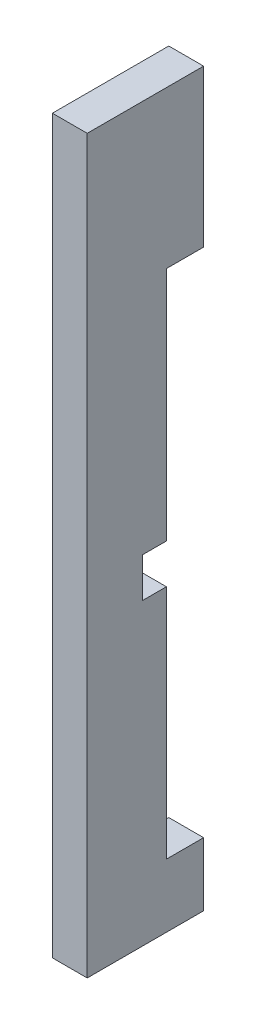
ISO-10303-21;
HEADER;
FILE_DESCRIPTION(('STEP AP214'),'2;1');
FILE_NAME('part.step','',(''),(''),'','','');
FILE_SCHEMA(('AUTOMOTIVE_DESIGN { 1 0 10303 214 1 1 1 1 }'));
ENDSEC;
DATA;
#1=APPLICATION_CONTEXT('core data for automotive mechanical design processes');
#2=APPLICATION_PROTOCOL_DEFINITION('international standard','automotive_design',2000,#1);
#3=PRODUCT_CONTEXT('',#1,'mechanical');
#4=PRODUCT('Part','Part','',(#3));
#5=PRODUCT_RELATED_PRODUCT_CATEGORY('part','',(#4));
#6=PRODUCT_DEFINITION_FORMATION('','',#4);
#7=PRODUCT_DEFINITION_CONTEXT('part definition',#1,'design');
#8=PRODUCT_DEFINITION('design','',#6,#7);
#9=PRODUCT_DEFINITION_SHAPE('','',#8);
#10=(LENGTH_UNIT() NAMED_UNIT(*) SI_UNIT(.MILLI.,.METRE.));
#11=(NAMED_UNIT(*) PLANE_ANGLE_UNIT() SI_UNIT($,.RADIAN.));
#12=(NAMED_UNIT(*) SI_UNIT($,.STERADIAN.) SOLID_ANGLE_UNIT());
#13=UNCERTAINTY_MEASURE_WITH_UNIT(LENGTH_MEASURE(1.E-05),#10,'distance_accuracy_value','');
#14=(GEOMETRIC_REPRESENTATION_CONTEXT(3) GLOBAL_UNCERTAINTY_ASSIGNED_CONTEXT((#13)) GLOBAL_UNIT_ASSIGNED_CONTEXT((#10,
#11,#12)) REPRESENTATION_CONTEXT('',''));
#15=CARTESIAN_POINT('',(0.,0.,0.));
#16=DIRECTION('',(0.,0.,1.));
#17=DIRECTION('',(1.,0.,0.));
#18=AXIS2_PLACEMENT_3D('',#15,#16,#17);
#19=CARTESIAN_POINT('',(0.,0.,0.));
#20=DIRECTION('',(0.,0.,-1.));
#21=DIRECTION('',(-1.,0.,0.));
#22=AXIS2_PLACEMENT_3D('',#19,#20,#21);
#23=PLANE('',#22);
#24=DIRECTION('',(1.,0.,0.));
#25=VECTOR('',#24,1.);
#26=CARTESIAN_POINT('',(105.,162.,9.33281230075522E-13));
#27=LINE('',#26,#25);
#28=CARTESIAN_POINT('',(118.,162.,9.33281230075522E-13));
#29=VERTEX_POINT('',#28);
#30=CARTESIAN_POINT('',(140.,162.,9.33281230075522E-13));
#31=VERTEX_POINT('',#30);
#32=EDGE_CURVE('E127',#29,#31,#27,.T.);
#33=ORIENTED_EDGE('',*,*,#32,.F.);
#34=DIRECTION('',(0.,-1.,0.));
#35=VECTOR('',#34,1.);
#36=CARTESIAN_POINT('',(118.,261.,0.));
#37=LINE('',#36,#35);
#38=CARTESIAN_POINT('',(118.,261.,0.));
#39=VERTEX_POINT('',#38);
#40=EDGE_CURVE('E161',#39,#29,#37,.T.);
#41=ORIENTED_EDGE('',*,*,#40,.F.);
#42=DIRECTION('',(-1.,0.,0.));
#43=VECTOR('',#42,1.);
#44=CARTESIAN_POINT('',(140.,261.,0.));
#45=LINE('',#44,#43);
#46=CARTESIAN_POINT('',(140.,261.,0.));
#47=VERTEX_POINT('',#46);
#48=EDGE_CURVE('E147',#47,#39,#45,.T.);
#49=ORIENTED_EDGE('',*,*,#48,.F.);
#50=DIRECTION('',(0.,1.,0.));
#51=VECTOR('',#50,1.);
#52=CARTESIAN_POINT('',(140.,261.,0.));
#53=LINE('',#52,#51);
#54=EDGE_CURVE('E142',#31,#47,#53,.T.);
#55=ORIENTED_EDGE('',*,*,#54,.F.);
#56=EDGE_LOOP('',(#33,#41,#49,#55));
#57=FACE_BOUND('',#56,.T.);
#58=ADVANCED_FACE('F37',(#57),#23,.T.);
#59=CARTESIAN_POINT('',(140.,261.,73.5));
#60=DIRECTION('',(-1.,0.,0.));
#61=DIRECTION('',(0.,-1.,0.));
#62=AXIS2_PLACEMENT_3D('',#59,#60,#61);
#63=PLANE('',#62);
#64=CARTESIAN_POINT('',(140.,-201.,0.));
#65=VERTEX_POINT('',#64);
#66=CARTESIAN_POINT('',(140.,-161.,4.02455846426619E-13));
#67=VERTEX_POINT('',#66);
#68=EDGE_CURVE('E149',#65,#67,#53,.T.);
#69=ORIENTED_EDGE('',*,*,#68,.T.);
#70=DIRECTION('',(0.,0.,-1.));
#71=VECTOR('',#70,1.);
#72=CARTESIAN_POINT('',(140.,-161.,4.02455846426619E-13));
#73=LINE('',#72,#71);
#74=CARTESIAN_POINT('',(140.,-161.,23.5));
#75=VERTEX_POINT('',#74);
#76=EDGE_CURVE('E137',#75,#67,#73,.T.);
#77=ORIENTED_EDGE('',*,*,#76,.F.);
#78=DIRECTION('',(0.,-1.,0.));
#79=VECTOR('',#78,1.);
#80=CARTESIAN_POINT('',(140.,162.,23.5));
#81=LINE('',#80,#79);
#82=CARTESIAN_POINT('',(140.,-11.9999999999998,23.5));
#83=VERTEX_POINT('',#82);
#84=EDGE_CURVE('E145',#83,#75,#81,.T.);
#85=ORIENTED_EDGE('',*,*,#84,.F.);
#86=DIRECTION('',(0.,0.,1.));
#87=VECTOR('',#86,1.);
#88=CARTESIAN_POINT('',(140.,-11.9999999999998,73.5));
#89=LINE('',#88,#87);
#90=CARTESIAN_POINT('',(140.,-11.9999999999998,38.5));
#91=VERTEX_POINT('',#90);
#92=EDGE_CURVE('E183',#83,#91,#89,.T.);
#93=ORIENTED_EDGE('',*,*,#92,.T.);
#94=DIRECTION('',(0.,1.,0.));
#95=VECTOR('',#94,1.);
#96=CARTESIAN_POINT('',(140.,261.,38.4999999999994));
#97=LINE('',#96,#95);
#98=CARTESIAN_POINT('',(140.,13.0000000000002,38.5));
#99=VERTEX_POINT('',#98);
#100=EDGE_CURVE('E150',#91,#99,#97,.T.);
#101=ORIENTED_EDGE('',*,*,#100,.T.);
#102=DIRECTION('',(0.,0.,-1.));
#103=VECTOR('',#102,1.);
#104=CARTESIAN_POINT('',(140.,13.0000000000002,73.5));
#105=LINE('',#104,#103);
#106=CARTESIAN_POINT('',(140.,13.0000000000002,23.5));
#107=VERTEX_POINT('',#106);
#108=EDGE_CURVE('E153',#99,#107,#105,.T.);
#109=ORIENTED_EDGE('',*,*,#108,.T.);
#110=CARTESIAN_POINT('',(140.,162.,23.5));
#111=VERTEX_POINT('',#110);
#112=EDGE_CURVE('E52',#111,#107,#81,.T.);
#113=ORIENTED_EDGE('',*,*,#112,.F.);
#114=DIRECTION('',(0.,0.,1.));
#115=VECTOR('',#114,1.);
#116=CARTESIAN_POINT('',(140.,162.,9.33281230075522E-13));
#117=LINE('',#116,#115);
#118=EDGE_CURVE('E131',#31,#111,#117,.T.);
#119=ORIENTED_EDGE('',*,*,#118,.F.);
#120=ORIENTED_EDGE('',*,*,#54,.T.);
#121=DIRECTION('',(0.,0.,-1.));
#122=VECTOR('',#121,1.);
#123=CARTESIAN_POINT('',(140.,261.,73.5));
#124=LINE('',#123,#122);
#125=CARTESIAN_POINT('',(140.,261.,73.5));
#126=VERTEX_POINT('',#125);
#127=EDGE_CURVE('E175',#126,#47,#124,.T.);
#128=ORIENTED_EDGE('',*,*,#127,.F.);
#129=DIRECTION('',(0.,1.,0.));
#130=VECTOR('',#129,1.);
#131=CARTESIAN_POINT('',(140.,261.,73.5));
#132=LINE('',#131,#130);
#133=CARTESIAN_POINT('',(140.,-201.,73.5));
#134=VERTEX_POINT('',#133);
#135=EDGE_CURVE('E165',#134,#126,#132,.T.);
#136=ORIENTED_EDGE('',*,*,#135,.F.);
#137=DIRECTION('',(0.,0.,-1.));
#138=VECTOR('',#137,1.);
#139=CARTESIAN_POINT('',(140.,-201.,73.5));
#140=LINE('',#139,#138);
#141=EDGE_CURVE('E166',#134,#65,#140,.T.);
#142=ORIENTED_EDGE('',*,*,#141,.T.);
#143=EDGE_LOOP('',(#69,#77,#85,#93,#101,#109,#113,#119,#120,#128,#136,#142));
#144=FACE_BOUND('',#143,.T.);
#145=ADVANCED_FACE('F39',(#144),#63,.F.);
#146=CARTESIAN_POINT('',(140.,261.,73.5));
#147=DIRECTION('',(0.,-1.,0.));
#148=DIRECTION('',(0.,0.,-1.));
#149=AXIS2_PLACEMENT_3D('',#146,#147,#148);
#150=PLANE('',#149);
#151=ORIENTED_EDGE('',*,*,#48,.T.);
#152=DIRECTION('',(0.,0.,-1.));
#153=VECTOR('',#152,1.);
#154=CARTESIAN_POINT('',(118.,261.,73.5));
#155=LINE('',#154,#153);
#156=CARTESIAN_POINT('',(118.,261.,73.5));
#157=VERTEX_POINT('',#156);
#158=EDGE_CURVE('E172',#157,#39,#155,.T.);
#159=ORIENTED_EDGE('',*,*,#158,.F.);
#160=DIRECTION('',(-1.,0.,0.));
#161=VECTOR('',#160,1.);
#162=CARTESIAN_POINT('',(140.,261.,73.5));
#163=LINE('',#162,#161);
#164=EDGE_CURVE('E211',#126,#157,#163,.T.);
#165=ORIENTED_EDGE('',*,*,#164,.F.);
#166=ORIENTED_EDGE('',*,*,#127,.T.);
#167=EDGE_LOOP('',(#151,#159,#165,#166));
#168=FACE_BOUND('',#167,.T.);
#169=ADVANCED_FACE('F225',(#168),#150,.F.);
#170=CARTESIAN_POINT('',(118.,261.,73.5));
#171=DIRECTION('',(1.,0.,0.));
#172=DIRECTION('',(0.,1.,0.));
#173=AXIS2_PLACEMENT_3D('',#170,#171,#172);
#174=PLANE('',#173);
#175=DIRECTION('',(0.,-1.,0.));
#176=VECTOR('',#175,1.);
#177=CARTESIAN_POINT('',(118.,261.,23.5));
#178=LINE('',#177,#176);
#179=CARTESIAN_POINT('',(118.,-11.9999999999998,23.5));
#180=VERTEX_POINT('',#179);
#181=CARTESIAN_POINT('',(118.,-161.,23.5));
#182=VERTEX_POINT('',#181);
#183=EDGE_CURVE('E60',#180,#182,#178,.T.);
#184=ORIENTED_EDGE('',*,*,#183,.T.);
#185=DIRECTION('',(0.,0.,-1.));
#186=VECTOR('',#185,1.);
#187=CARTESIAN_POINT('',(118.,-161.,73.5));
#188=LINE('',#187,#186);
#189=CARTESIAN_POINT('',(118.,-161.,4.02455846426619E-13));
#190=VERTEX_POINT('',#189);
#191=EDGE_CURVE('E193',#182,#190,#188,.T.);
#192=ORIENTED_EDGE('',*,*,#191,.T.);
#193=CARTESIAN_POINT('',(118.,-201.,0.));
#194=VERTEX_POINT('',#193);
#195=EDGE_CURVE('E160',#190,#194,#37,.T.);
#196=ORIENTED_EDGE('',*,*,#195,.T.);
#197=DIRECTION('',(0.,0.,-1.));
#198=VECTOR('',#197,1.);
#199=CARTESIAN_POINT('',(118.,-201.,73.5));
#200=LINE('',#199,#198);
#201=CARTESIAN_POINT('',(118.,-201.,73.5));
#202=VERTEX_POINT('',#201);
#203=EDGE_CURVE('E169',#202,#194,#200,.T.);
#204=ORIENTED_EDGE('',*,*,#203,.F.);
#205=DIRECTION('',(0.,-1.,0.));
#206=VECTOR('',#205,1.);
#207=CARTESIAN_POINT('',(118.,261.,73.5));
#208=LINE('',#207,#206);
#209=EDGE_CURVE('E212',#157,#202,#208,.T.);
#210=ORIENTED_EDGE('',*,*,#209,.F.);
#211=ORIENTED_EDGE('',*,*,#158,.T.);
#212=ORIENTED_EDGE('',*,*,#40,.T.);
#213=DIRECTION('',(0.,0.,1.));
#214=VECTOR('',#213,1.);
#215=CARTESIAN_POINT('',(118.,162.,73.5));
#216=LINE('',#215,#214);
#217=CARTESIAN_POINT('',(118.,162.,23.5));
#218=VERTEX_POINT('',#217);
#219=EDGE_CURVE('E11',#29,#218,#216,.T.);
#220=ORIENTED_EDGE('',*,*,#219,.T.);
#221=CARTESIAN_POINT('',(118.,13.0000000000002,23.5));
#222=VERTEX_POINT('',#221);
#223=EDGE_CURVE('E197',#218,#222,#178,.T.);
#224=ORIENTED_EDGE('',*,*,#223,.T.);
#225=DIRECTION('',(0.,0.,-1.));
#226=VECTOR('',#225,1.);
#227=CARTESIAN_POINT('',(118.,13.0000000000002,0.));
#228=LINE('',#227,#226);
#229=CARTESIAN_POINT('',(118.,13.0000000000002,38.5));
#230=VERTEX_POINT('',#229);
#231=EDGE_CURVE('E195',#230,#222,#228,.T.);
#232=ORIENTED_EDGE('',*,*,#231,.F.);
#233=DIRECTION('',(0.,1.,0.));
#234=VECTOR('',#233,1.);
#235=CARTESIAN_POINT('',(118.,13.0000000000002,38.5));
#236=LINE('',#235,#234);
#237=CARTESIAN_POINT('',(118.,-11.9999999999998,38.5));
#238=VERTEX_POINT('',#237);
#239=EDGE_CURVE('E192',#238,#230,#236,.T.);
#240=ORIENTED_EDGE('',*,*,#239,.F.);
#241=DIRECTION('',(0.,0.,1.));
#242=VECTOR('',#241,1.);
#243=CARTESIAN_POINT('',(118.,-11.9999999999998,38.5));
#244=LINE('',#243,#242);
#245=EDGE_CURVE('E181',#180,#238,#244,.T.);
#246=ORIENTED_EDGE('',*,*,#245,.F.);
#247=EDGE_LOOP('',(#184,#192,#196,#204,#210,#211,#212,#220,#224,#232,#240,#246));
#248=FACE_BOUND('',#247,.T.);
#249=ADVANCED_FACE('F188',(#248),#174,.F.);
#250=CARTESIAN_POINT('',(140.,-201.,73.5));
#251=DIRECTION('',(0.,1.,0.));
#252=DIRECTION('',(0.,0.,1.));
#253=AXIS2_PLACEMENT_3D('',#250,#251,#252);
#254=PLANE('',#253);
#255=DIRECTION('',(1.,0.,0.));
#256=VECTOR('',#255,1.);
#257=CARTESIAN_POINT('',(140.,-201.,0.));
#258=LINE('',#257,#256);
#259=EDGE_CURVE('E163',#194,#65,#258,.T.);
#260=ORIENTED_EDGE('',*,*,#259,.T.);
#261=ORIENTED_EDGE('',*,*,#141,.F.);
#262=DIRECTION('',(1.,0.,0.));
#263=VECTOR('',#262,1.);
#264=CARTESIAN_POINT('',(140.,-201.,73.5));
#265=LINE('',#264,#263);
#266=EDGE_CURVE('E157',#202,#134,#265,.T.);
#267=ORIENTED_EDGE('',*,*,#266,.F.);
#268=ORIENTED_EDGE('',*,*,#203,.T.);
#269=EDGE_LOOP('',(#260,#261,#267,#268));
#270=FACE_BOUND('',#269,.T.);
#271=ADVANCED_FACE('F221',(#270),#254,.F.);
#272=CARTESIAN_POINT('',(0.,0.,73.5));
#273=DIRECTION('',(0.,0.,-1.));
#274=DIRECTION('',(-1.,0.,0.));
#275=AXIS2_PLACEMENT_3D('',#272,#273,#274);
#276=PLANE('',#275);
#277=ORIENTED_EDGE('',*,*,#135,.T.);
#278=ORIENTED_EDGE('',*,*,#164,.T.);
#279=ORIENTED_EDGE('',*,*,#209,.T.);
#280=ORIENTED_EDGE('',*,*,#266,.T.);
#281=EDGE_LOOP('',(#277,#278,#279,#280));
#282=FACE_BOUND('',#281,.T.);
#283=ADVANCED_FACE('F218',(#282),#276,.F.);
#284=DIRECTION('',(1.,0.,0.));
#285=VECTOR('',#284,1.);
#286=CARTESIAN_POINT('',(105.,-161.,4.02455846426619E-13));
#287=LINE('',#286,#285);
#288=EDGE_CURVE('E231',#190,#67,#287,.T.);
#289=ORIENTED_EDGE('',*,*,#288,.T.);
#290=ORIENTED_EDGE('',*,*,#68,.F.);
#291=ORIENTED_EDGE('',*,*,#259,.F.);
#292=ORIENTED_EDGE('',*,*,#195,.F.);
#293=EDGE_LOOP('',(#289,#290,#291,#292));
#294=FACE_BOUND('',#293,.T.);
#295=ADVANCED_FACE('F230',(#294),#23,.T.);
#296=CARTESIAN_POINT('',(153.,13.0000000000002,38.5));
#297=DIRECTION('',(0.,0.,1.));
#298=DIRECTION('',(0.,-1.,0.));
#299=AXIS2_PLACEMENT_3D('',#296,#297,#298);
#300=PLANE('',#299);
#301=DIRECTION('',(-1.,0.,0.));
#302=VECTOR('',#301,1.);
#303=CARTESIAN_POINT('',(153.,-11.9999999999998,38.5));
#304=LINE('',#303,#302);
#305=EDGE_CURVE('E203',#91,#238,#304,.T.);
#306=ORIENTED_EDGE('',*,*,#305,.T.);
#307=ORIENTED_EDGE('',*,*,#239,.T.);
#308=DIRECTION('',(-1.,0.,0.));
#309=VECTOR('',#308,1.);
#310=CARTESIAN_POINT('',(153.,13.0000000000002,38.5));
#311=LINE('',#310,#309);
#312=EDGE_CURVE('E204',#99,#230,#311,.T.);
#313=ORIENTED_EDGE('',*,*,#312,.F.);
#314=ORIENTED_EDGE('',*,*,#100,.F.);
#315=EDGE_LOOP('',(#306,#307,#313,#314));
#316=FACE_BOUND('',#315,.T.);
#317=ADVANCED_FACE('F248',(#316),#300,.F.);
#318=CARTESIAN_POINT('',(153.,13.0000000000002,0.));
#319=DIRECTION('',(0.,1.,0.));
#320=DIRECTION('',(-1.,0.,0.));
#321=AXIS2_PLACEMENT_3D('',#318,#319,#320);
#322=PLANE('',#321);
#323=ORIENTED_EDGE('',*,*,#231,.T.);
#324=DIRECTION('',(1.,0.,0.));
#325=VECTOR('',#324,1.);
#326=CARTESIAN_POINT('',(153.,13.0000000000002,23.5));
#327=LINE('',#326,#325);
#328=EDGE_CURVE('E241',#222,#107,#327,.T.);
#329=ORIENTED_EDGE('',*,*,#328,.T.);
#330=ORIENTED_EDGE('',*,*,#108,.F.);
#331=ORIENTED_EDGE('',*,*,#312,.T.);
#332=EDGE_LOOP('',(#323,#329,#330,#331));
#333=FACE_BOUND('',#332,.T.);
#334=ADVANCED_FACE('F244',(#333),#322,.F.);
#335=CARTESIAN_POINT('',(153.,-11.9999999999998,38.5));
#336=DIRECTION('',(0.,-1.,0.));
#337=DIRECTION('',(1.,0.,0.));
#338=AXIS2_PLACEMENT_3D('',#335,#336,#337);
#339=PLANE('',#338);
#340=ORIENTED_EDGE('',*,*,#92,.F.);
#341=DIRECTION('',(-1.,0.,0.));
#342=VECTOR('',#341,1.);
#343=CARTESIAN_POINT('',(153.,-11.9999999999998,23.5));
#344=LINE('',#343,#342);
#345=EDGE_CURVE('E45',#83,#180,#344,.T.);
#346=ORIENTED_EDGE('',*,*,#345,.T.);
#347=ORIENTED_EDGE('',*,*,#245,.T.);
#348=ORIENTED_EDGE('',*,*,#305,.F.);
#349=EDGE_LOOP('',(#340,#346,#347,#348));
#350=FACE_BOUND('',#349,.T.);
#351=ADVANCED_FACE('F179',(#350),#339,.F.);
#352=CARTESIAN_POINT('',(105.,162.,23.5));
#353=DIRECTION('',(0.,0.,1.));
#354=DIRECTION('',(0.,-1.,0.));
#355=AXIS2_PLACEMENT_3D('',#352,#353,#354);
#356=PLANE('',#355);
#357=ORIENTED_EDGE('',*,*,#345,.F.);
#358=ORIENTED_EDGE('',*,*,#84,.T.);
#359=DIRECTION('',(1.,0.,0.));
#360=VECTOR('',#359,1.);
#361=CARTESIAN_POINT('',(105.,-161.,23.5));
#362=LINE('',#361,#360);
#363=EDGE_CURVE('E238',#182,#75,#362,.T.);
#364=ORIENTED_EDGE('',*,*,#363,.F.);
#365=ORIENTED_EDGE('',*,*,#183,.F.);
#366=EDGE_LOOP('',(#357,#358,#364,#365));
#367=FACE_BOUND('',#366,.T.);
#368=ADVANCED_FACE('F306',(#367),#356,.F.);
#369=CARTESIAN_POINT('',(105.,-161.,4.02455846426619E-13));
#370=DIRECTION('',(0.,-1.,0.));
#371=DIRECTION('',(1.,0.,0.));
#372=AXIS2_PLACEMENT_3D('',#369,#370,#371);
#373=PLANE('',#372);
#374=ORIENTED_EDGE('',*,*,#363,.T.);
#375=ORIENTED_EDGE('',*,*,#76,.T.);
#376=ORIENTED_EDGE('',*,*,#288,.F.);
#377=ORIENTED_EDGE('',*,*,#191,.F.);
#378=EDGE_LOOP('',(#374,#375,#376,#377));
#379=FACE_BOUND('',#378,.T.);
#380=ADVANCED_FACE('F314',(#379),#373,.F.);
#381=CARTESIAN_POINT('',(105.,162.,9.33281230075522E-13));
#382=DIRECTION('',(0.,1.,0.));
#383=DIRECTION('',(-1.,0.,0.));
#384=AXIS2_PLACEMENT_3D('',#381,#382,#383);
#385=PLANE('',#384);
#386=ORIENTED_EDGE('',*,*,#32,.T.);
#387=ORIENTED_EDGE('',*,*,#118,.T.);
#388=DIRECTION('',(1.,0.,0.));
#389=VECTOR('',#388,1.);
#390=CARTESIAN_POINT('',(105.,162.,23.5));
#391=LINE('',#390,#389);
#392=EDGE_CURVE('E136',#218,#111,#391,.T.);
#393=ORIENTED_EDGE('',*,*,#392,.F.);
#394=ORIENTED_EDGE('',*,*,#219,.F.);
#395=EDGE_LOOP('',(#386,#387,#393,#394));
#396=FACE_BOUND('',#395,.T.);
#397=ADVANCED_FACE('F129',(#396),#385,.F.);
#398=ORIENTED_EDGE('',*,*,#392,.T.);
#399=ORIENTED_EDGE('',*,*,#112,.T.);
#400=ORIENTED_EDGE('',*,*,#328,.F.);
#401=ORIENTED_EDGE('',*,*,#223,.F.);
#402=EDGE_LOOP('',(#398,#399,#400,#401));
#403=FACE_BOUND('',#402,.T.);
#404=ADVANCED_FACE('F316',(#403),#356,.F.);
#405=CLOSED_SHELL('',(#58,#145,#169,#249,#271,#283,#295,#317,#334,#351,#368,#380,#397,#404));
#406=MANIFOLD_SOLID_BREP('B2',#405);
#407=ADVANCED_BREP_SHAPE_REPRESENTATION('',(#18,#406),#14);
#408=SHAPE_DEFINITION_REPRESENTATION(#9,#407);
ENDSEC;
END-ISO-10303-21;
